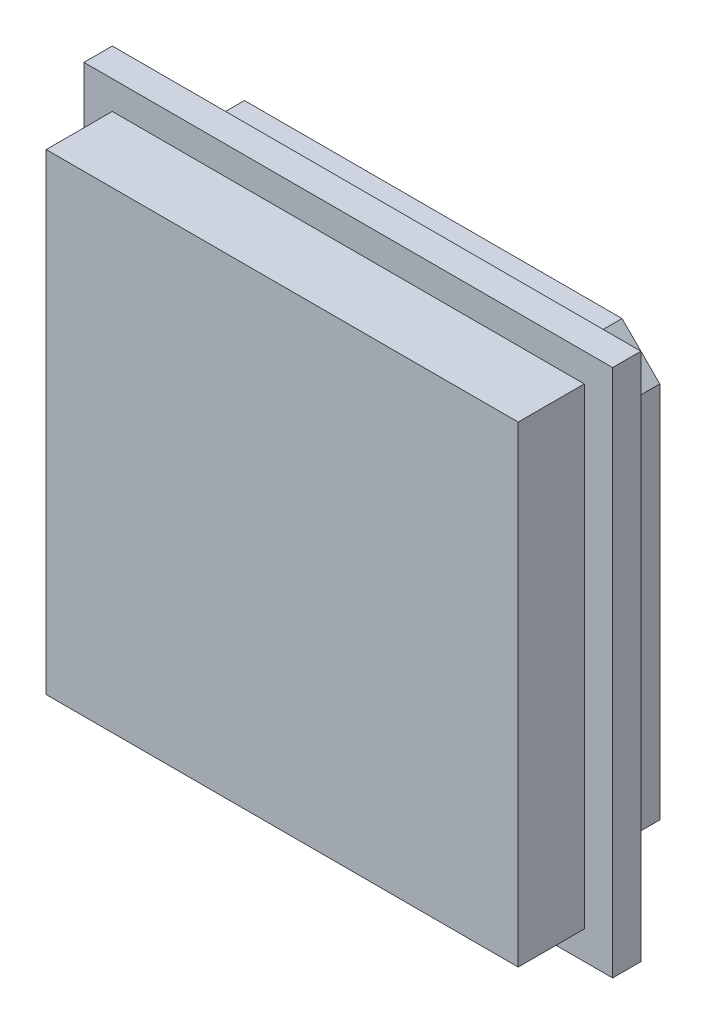
ISO-10303-21;
HEADER;
FILE_DESCRIPTION(('STEP AP214'),'2;1');
FILE_NAME('part.step','',(''),(''),'','','');
FILE_SCHEMA(('AUTOMOTIVE_DESIGN { 1 0 10303 214 1 1 1 1 }'));
ENDSEC;
DATA;
#1=APPLICATION_CONTEXT('core data for automotive mechanical design processes');
#2=APPLICATION_PROTOCOL_DEFINITION('international standard','automotive_design',2000,#1);
#3=PRODUCT_CONTEXT('',#1,'mechanical');
#4=PRODUCT('Part','Part','',(#3));
#5=PRODUCT_RELATED_PRODUCT_CATEGORY('part','',(#4));
#6=PRODUCT_DEFINITION_FORMATION('','',#4);
#7=PRODUCT_DEFINITION_CONTEXT('part definition',#1,'design');
#8=PRODUCT_DEFINITION('design','',#6,#7);
#9=PRODUCT_DEFINITION_SHAPE('','',#8);
#10=(LENGTH_UNIT() NAMED_UNIT(*) SI_UNIT(.MILLI.,.METRE.));
#11=(NAMED_UNIT(*) PLANE_ANGLE_UNIT() SI_UNIT($,.RADIAN.));
#12=(NAMED_UNIT(*) SI_UNIT($,.STERADIAN.) SOLID_ANGLE_UNIT());
#13=UNCERTAINTY_MEASURE_WITH_UNIT(LENGTH_MEASURE(1.E-05),#10,'distance_accuracy_value','');
#14=(GEOMETRIC_REPRESENTATION_CONTEXT(3) GLOBAL_UNCERTAINTY_ASSIGNED_CONTEXT((#13)) GLOBAL_UNIT_ASSIGNED_CONTEXT((#10,
#11,#12)) REPRESENTATION_CONTEXT('',''));
#15=CARTESIAN_POINT('',(0.,0.,0.));
#16=DIRECTION('',(0.,0.,1.));
#17=DIRECTION('',(1.,0.,0.));
#18=AXIS2_PLACEMENT_3D('',#15,#16,#17);
#19=CARTESIAN_POINT('',(0.,0.,4.5));
#20=DIRECTION('',(0.,0.,-1.));
#21=DIRECTION('',(-1.,0.,0.));
#22=AXIS2_PLACEMENT_3D('',#19,#20,#21);
#23=PLANE('',#22);
#24=DIRECTION('',(0.,1.,0.));
#25=VECTOR('',#24,1.);
#26=CARTESIAN_POINT('',(-162.007283518404,38.,4.5));
#27=LINE('',#26,#25);
#28=CARTESIAN_POINT('',(-162.007283518404,10.,4.5));
#29=VERTEX_POINT('',#28);
#30=CARTESIAN_POINT('',(-162.007283518404,38.,4.5));
#31=VERTEX_POINT('',#30);
#32=EDGE_CURVE('E175',#29,#31,#27,.T.);
#33=ORIENTED_EDGE('',*,*,#32,.T.);
#34=DIRECTION('',(-1.,0.,0.));
#35=VECTOR('',#34,1.);
#36=CARTESIAN_POINT('',(-162.007283518404,38.,4.5));
#37=LINE('',#36,#35);
#38=CARTESIAN_POINT('',(-190.007283518404,38.,4.5));
#39=VERTEX_POINT('',#38);
#40=EDGE_CURVE('E178',#31,#39,#37,.T.);
#41=ORIENTED_EDGE('',*,*,#40,.T.);
#42=DIRECTION('',(0.,-1.,0.));
#43=VECTOR('',#42,1.);
#44=CARTESIAN_POINT('',(-190.007283518404,38.,4.5));
#45=LINE('',#44,#43);
#46=CARTESIAN_POINT('',(-190.007283518404,9.99999999999999,4.5));
#47=VERTEX_POINT('',#46);
#48=EDGE_CURVE('E181',#39,#47,#45,.T.);
#49=ORIENTED_EDGE('',*,*,#48,.T.);
#50=DIRECTION('',(1.,0.,0.));
#51=VECTOR('',#50,1.);
#52=CARTESIAN_POINT('',(-162.007283518404,10.,4.5));
#53=LINE('',#52,#51);
#54=EDGE_CURVE('E183',#47,#29,#53,.T.);
#55=ORIENTED_EDGE('',*,*,#54,.T.);
#56=EDGE_LOOP('',(#33,#41,#49,#55));
#57=FACE_BOUND('',#56,.T.);
#58=DIRECTION('',(0.,1.,0.));
#59=VECTOR('',#58,1.);
#60=CARTESIAN_POINT('',(-163.507283518404,36.5,4.5));
#61=LINE('',#60,#59);
#62=CARTESIAN_POINT('',(-163.507283518404,11.5,4.5));
#63=VERTEX_POINT('',#62);
#64=CARTESIAN_POINT('',(-163.507283518404,36.5,4.5));
#65=VERTEX_POINT('',#64);
#66=EDGE_CURVE('E48',#63,#65,#61,.T.);
#67=ORIENTED_EDGE('',*,*,#66,.F.);
#68=DIRECTION('',(1.,0.,0.));
#69=VECTOR('',#68,1.);
#70=CARTESIAN_POINT('',(-163.507283518404,11.5,4.5));
#71=LINE('',#70,#69);
#72=CARTESIAN_POINT('',(-188.507283518404,11.5,4.5));
#73=VERTEX_POINT('',#72);
#74=EDGE_CURVE('E52',#73,#63,#71,.T.);
#75=ORIENTED_EDGE('',*,*,#74,.F.);
#76=DIRECTION('',(0.,-1.,0.));
#77=VECTOR('',#76,1.);
#78=CARTESIAN_POINT('',(-188.507283518404,36.5,4.5));
#79=LINE('',#78,#77);
#80=CARTESIAN_POINT('',(-188.507283518404,36.5,4.5));
#81=VERTEX_POINT('',#80);
#82=EDGE_CURVE('E469',#81,#73,#79,.T.);
#83=ORIENTED_EDGE('',*,*,#82,.F.);
#84=DIRECTION('',(-1.,0.,0.));
#85=VECTOR('',#84,1.);
#86=CARTESIAN_POINT('',(-163.507283518404,36.5,4.5));
#87=LINE('',#86,#85);
#88=EDGE_CURVE('E475',#65,#81,#87,.T.);
#89=ORIENTED_EDGE('',*,*,#88,.F.);
#90=EDGE_LOOP('',(#67,#75,#83,#89));
#91=FACE_BOUND('',#90,.T.);
#92=ADVANCED_FACE('F33',(#57,#91),#23,.F.);
#93=CARTESIAN_POINT('',(-186.007283518404,36.,3.));
#94=DIRECTION('',(0.707106781186548,-0.707106781186548,0.));
#95=DIRECTION('',(0.707106781186548,0.707106781186548,0.));
#96=AXIS2_PLACEMENT_3D('',#93,#94,#95);
#97=PLANE('',#96);
#98=DIRECTION('',(-0.707106781186547,-0.707106781186547,0.));
#99=VECTOR('',#98,1.);
#100=CARTESIAN_POINT('',(-186.007283518404,36.,0.));
#101=LINE('',#100,#99);
#102=CARTESIAN_POINT('',(-186.007283518404,36.,0.));
#103=VERTEX_POINT('',#102);
#104=CARTESIAN_POINT('',(-188.007283518404,34.,0.));
#105=VERTEX_POINT('',#104);
#106=EDGE_CURVE('E201',#103,#105,#101,.T.);
#107=ORIENTED_EDGE('',*,*,#106,.T.);
#108=DIRECTION('',(0.,0.,-1.));
#109=VECTOR('',#108,1.);
#110=CARTESIAN_POINT('',(-188.007283518404,34.,3.));
#111=LINE('',#110,#109);
#112=CARTESIAN_POINT('',(-188.007283518404,34.,3.));
#113=VERTEX_POINT('',#112);
#114=EDGE_CURVE('E11',#113,#105,#111,.T.);
#115=ORIENTED_EDGE('',*,*,#114,.F.);
#116=DIRECTION('',(-0.707106781186547,-0.707106781186547,0.));
#117=VECTOR('',#116,1.);
#118=CARTESIAN_POINT('',(-186.007283518404,36.,3.));
#119=LINE('',#118,#117);
#120=CARTESIAN_POINT('',(-186.007283518404,36.,3.));
#121=VERTEX_POINT('',#120);
#122=EDGE_CURVE('E202',#121,#113,#119,.T.);
#123=ORIENTED_EDGE('',*,*,#122,.F.);
#124=DIRECTION('',(0.,0.,-1.));
#125=VECTOR('',#124,1.);
#126=CARTESIAN_POINT('',(-186.007283518404,36.,3.));
#127=LINE('',#126,#125);
#128=EDGE_CURVE('E227',#121,#103,#127,.T.);
#129=ORIENTED_EDGE('',*,*,#128,.T.);
#130=EDGE_LOOP('',(#107,#115,#123,#129));
#131=FACE_BOUND('',#130,.T.);
#132=ADVANCED_FACE('F35',(#131),#97,.F.);
#133=CARTESIAN_POINT('',(-188.007283518404,34.,3.));
#134=DIRECTION('',(1.,0.,0.));
#135=DIRECTION('',(0.,0.,-1.));
#136=AXIS2_PLACEMENT_3D('',#133,#134,#135);
#137=PLANE('',#136);
#138=DIRECTION('',(0.,-1.,0.));
#139=VECTOR('',#138,1.);
#140=CARTESIAN_POINT('',(-188.007283518404,34.,0.));
#141=LINE('',#140,#139);
#142=CARTESIAN_POINT('',(-188.007283518404,14.,0.));
#143=VERTEX_POINT('',#142);
#144=EDGE_CURVE('E230',#105,#143,#141,.T.);
#145=ORIENTED_EDGE('',*,*,#144,.T.);
#146=DIRECTION('',(0.,0.,-1.));
#147=VECTOR('',#146,1.);
#148=CARTESIAN_POINT('',(-188.007283518404,14.,3.));
#149=LINE('',#148,#147);
#150=CARTESIAN_POINT('',(-188.007283518404,14.,3.));
#151=VERTEX_POINT('',#150);
#152=EDGE_CURVE('E41',#151,#143,#149,.T.);
#153=ORIENTED_EDGE('',*,*,#152,.F.);
#154=DIRECTION('',(0.,-1.,0.));
#155=VECTOR('',#154,1.);
#156=CARTESIAN_POINT('',(-188.007283518404,34.,3.));
#157=LINE('',#156,#155);
#158=EDGE_CURVE('E205',#113,#151,#157,.T.);
#159=ORIENTED_EDGE('',*,*,#158,.F.);
#160=ORIENTED_EDGE('',*,*,#114,.T.);
#161=EDGE_LOOP('',(#145,#153,#159,#160));
#162=FACE_BOUND('',#161,.T.);
#163=ADVANCED_FACE('F282',(#162),#137,.F.);
#164=CARTESIAN_POINT('',(-186.007283518404,12.,3.));
#165=DIRECTION('',(0.707106781186547,0.707106781186548,0.));
#166=DIRECTION('',(-0.707106781186548,0.707106781186547,0.));
#167=AXIS2_PLACEMENT_3D('',#164,#165,#166);
#168=PLANE('',#167);
#169=DIRECTION('',(0.707106781186548,-0.707106781186547,0.));
#170=VECTOR('',#169,1.);
#171=CARTESIAN_POINT('',(-186.007283518404,12.,0.));
#172=LINE('',#171,#170);
#173=CARTESIAN_POINT('',(-186.007283518404,12.,0.));
#174=VERTEX_POINT('',#173);
#175=EDGE_CURVE('E232',#143,#174,#172,.T.);
#176=ORIENTED_EDGE('',*,*,#175,.T.);
#177=DIRECTION('',(0.,0.,-1.));
#178=VECTOR('',#177,1.);
#179=CARTESIAN_POINT('',(-186.007283518404,12.,3.));
#180=LINE('',#179,#178);
#181=CARTESIAN_POINT('',(-186.007283518404,12.,3.));
#182=VERTEX_POINT('',#181);
#183=EDGE_CURVE('E257',#182,#174,#180,.T.);
#184=ORIENTED_EDGE('',*,*,#183,.F.);
#185=DIRECTION('',(0.707106781186548,-0.707106781186547,0.));
#186=VECTOR('',#185,1.);
#187=CARTESIAN_POINT('',(-186.007283518404,12.,3.));
#188=LINE('',#187,#186);
#189=EDGE_CURVE('E209',#151,#182,#188,.T.);
#190=ORIENTED_EDGE('',*,*,#189,.F.);
#191=ORIENTED_EDGE('',*,*,#152,.T.);
#192=EDGE_LOOP('',(#176,#184,#190,#191));
#193=FACE_BOUND('',#192,.T.);
#194=ADVANCED_FACE('F263',(#193),#168,.F.);
#195=CARTESIAN_POINT('',(-166.007283518404,12.,3.));
#196=DIRECTION('',(0.,1.,0.));
#197=DIRECTION('',(-1.,0.,0.));
#198=AXIS2_PLACEMENT_3D('',#195,#196,#197);
#199=PLANE('',#198);
#200=DIRECTION('',(1.,0.,0.));
#201=VECTOR('',#200,1.);
#202=CARTESIAN_POINT('',(-166.007283518404,12.,0.));
#203=LINE('',#202,#201);
#204=CARTESIAN_POINT('',(-166.007283518404,12.,0.));
#205=VERTEX_POINT('',#204);
#206=EDGE_CURVE('E234',#174,#205,#203,.T.);
#207=ORIENTED_EDGE('',*,*,#206,.T.);
#208=DIRECTION('',(0.,0.,-1.));
#209=VECTOR('',#208,1.);
#210=CARTESIAN_POINT('',(-166.007283518404,12.,3.));
#211=LINE('',#210,#209);
#212=CARTESIAN_POINT('',(-166.007283518404,12.,3.));
#213=VERTEX_POINT('',#212);
#214=EDGE_CURVE('E254',#213,#205,#211,.T.);
#215=ORIENTED_EDGE('',*,*,#214,.F.);
#216=DIRECTION('',(1.,0.,0.));
#217=VECTOR('',#216,1.);
#218=CARTESIAN_POINT('',(-166.007283518404,12.,3.));
#219=LINE('',#218,#217);
#220=EDGE_CURVE('E212',#182,#213,#219,.T.);
#221=ORIENTED_EDGE('',*,*,#220,.F.);
#222=ORIENTED_EDGE('',*,*,#183,.T.);
#223=EDGE_LOOP('',(#207,#215,#221,#222));
#224=FACE_BOUND('',#223,.T.);
#225=ADVANCED_FACE('F272',(#224),#199,.F.);
#226=CARTESIAN_POINT('',(-164.007283518404,14.,3.));
#227=DIRECTION('',(-0.707106781186547,0.707106781186548,0.));
#228=DIRECTION('',(-0.707106781186548,-0.707106781186547,0.));
#229=AXIS2_PLACEMENT_3D('',#226,#227,#228);
#230=PLANE('',#229);
#231=DIRECTION('',(0.707106781186548,0.707106781186547,0.));
#232=VECTOR('',#231,1.);
#233=CARTESIAN_POINT('',(-164.007283518404,14.,0.));
#234=LINE('',#233,#232);
#235=CARTESIAN_POINT('',(-164.007283518404,14.,0.));
#236=VERTEX_POINT('',#235);
#237=EDGE_CURVE('E236',#205,#236,#234,.T.);
#238=ORIENTED_EDGE('',*,*,#237,.T.);
#239=DIRECTION('',(0.,0.,-1.));
#240=VECTOR('',#239,1.);
#241=CARTESIAN_POINT('',(-164.007283518404,14.,3.));
#242=LINE('',#241,#240);
#243=CARTESIAN_POINT('',(-164.007283518404,14.,3.));
#244=VERTEX_POINT('',#243);
#245=EDGE_CURVE('E251',#244,#236,#242,.T.);
#246=ORIENTED_EDGE('',*,*,#245,.F.);
#247=DIRECTION('',(0.707106781186548,0.707106781186547,0.));
#248=VECTOR('',#247,1.);
#249=CARTESIAN_POINT('',(-164.007283518404,14.,3.));
#250=LINE('',#249,#248);
#251=EDGE_CURVE('E215',#213,#244,#250,.T.);
#252=ORIENTED_EDGE('',*,*,#251,.F.);
#253=ORIENTED_EDGE('',*,*,#214,.T.);
#254=EDGE_LOOP('',(#238,#246,#252,#253));
#255=FACE_BOUND('',#254,.T.);
#256=ADVANCED_FACE('F276',(#255),#230,.F.);
#257=CARTESIAN_POINT('',(-164.007283518404,34.,3.));
#258=DIRECTION('',(-1.,0.,0.));
#259=DIRECTION('',(0.,0.,1.));
#260=AXIS2_PLACEMENT_3D('',#257,#258,#259);
#261=PLANE('',#260);
#262=DIRECTION('',(0.,1.,0.));
#263=VECTOR('',#262,1.);
#264=CARTESIAN_POINT('',(-164.007283518404,34.,0.));
#265=LINE('',#264,#263);
#266=CARTESIAN_POINT('',(-164.007283518404,34.,0.));
#267=VERTEX_POINT('',#266);
#268=EDGE_CURVE('E238',#236,#267,#265,.T.);
#269=ORIENTED_EDGE('',*,*,#268,.T.);
#270=DIRECTION('',(0.,0.,-1.));
#271=VECTOR('',#270,1.);
#272=CARTESIAN_POINT('',(-164.007283518404,34.,3.));
#273=LINE('',#272,#271);
#274=CARTESIAN_POINT('',(-164.007283518404,34.,3.));
#275=VERTEX_POINT('',#274);
#276=EDGE_CURVE('E248',#275,#267,#273,.T.);
#277=ORIENTED_EDGE('',*,*,#276,.F.);
#278=DIRECTION('',(0.,1.,0.));
#279=VECTOR('',#278,1.);
#280=CARTESIAN_POINT('',(-164.007283518404,34.,3.));
#281=LINE('',#280,#279);
#282=EDGE_CURVE('E218',#244,#275,#281,.T.);
#283=ORIENTED_EDGE('',*,*,#282,.F.);
#284=ORIENTED_EDGE('',*,*,#245,.T.);
#285=EDGE_LOOP('',(#269,#277,#283,#284));
#286=FACE_BOUND('',#285,.T.);
#287=ADVANCED_FACE('F294',(#286),#261,.F.);
#288=CARTESIAN_POINT('',(-164.007283518404,34.,3.));
#289=DIRECTION('',(-0.707106781186548,-0.707106781186548,0.));
#290=DIRECTION('',(0.707106781186548,-0.707106781186548,0.));
#291=AXIS2_PLACEMENT_3D('',#288,#289,#290);
#292=PLANE('',#291);
#293=DIRECTION('',(-0.707106781186547,0.707106781186547,0.));
#294=VECTOR('',#293,1.);
#295=CARTESIAN_POINT('',(-164.007283518404,34.,0.));
#296=LINE('',#295,#294);
#297=CARTESIAN_POINT('',(-166.007283518404,36.,0.));
#298=VERTEX_POINT('',#297);
#299=EDGE_CURVE('E240',#267,#298,#296,.T.);
#300=ORIENTED_EDGE('',*,*,#299,.T.);
#301=DIRECTION('',(0.,0.,-1.));
#302=VECTOR('',#301,1.);
#303=CARTESIAN_POINT('',(-166.007283518404,36.,3.));
#304=LINE('',#303,#302);
#305=CARTESIAN_POINT('',(-166.007283518404,36.,3.));
#306=VERTEX_POINT('',#305);
#307=EDGE_CURVE('E245',#306,#298,#304,.T.);
#308=ORIENTED_EDGE('',*,*,#307,.F.);
#309=DIRECTION('',(-0.707106781186547,0.707106781186547,0.));
#310=VECTOR('',#309,1.);
#311=CARTESIAN_POINT('',(-164.007283518404,34.,3.));
#312=LINE('',#311,#310);
#313=EDGE_CURVE('E221',#275,#306,#312,.T.);
#314=ORIENTED_EDGE('',*,*,#313,.F.);
#315=ORIENTED_EDGE('',*,*,#276,.T.);
#316=EDGE_LOOP('',(#300,#308,#314,#315));
#317=FACE_BOUND('',#316,.T.);
#318=ADVANCED_FACE('F292',(#317),#292,.F.);
#319=CARTESIAN_POINT('',(-166.007283518404,36.,3.));
#320=DIRECTION('',(0.,-1.,0.));
#321=DIRECTION('',(0.,0.,-1.));
#322=AXIS2_PLACEMENT_3D('',#319,#320,#321);
#323=PLANE('',#322);
#324=DIRECTION('',(-1.,0.,0.));
#325=VECTOR('',#324,1.);
#326=CARTESIAN_POINT('',(-166.007283518404,36.,0.));
#327=LINE('',#326,#325);
#328=EDGE_CURVE('E206',#298,#103,#327,.T.);
#329=ORIENTED_EDGE('',*,*,#328,.T.);
#330=ORIENTED_EDGE('',*,*,#128,.F.);
#331=DIRECTION('',(-1.,0.,0.));
#332=VECTOR('',#331,1.);
#333=CARTESIAN_POINT('',(-166.007283518404,36.,3.));
#334=LINE('',#333,#332);
#335=EDGE_CURVE('E224',#306,#121,#334,.T.);
#336=ORIENTED_EDGE('',*,*,#335,.F.);
#337=ORIENTED_EDGE('',*,*,#307,.T.);
#338=EDGE_LOOP('',(#329,#330,#336,#337));
#339=FACE_BOUND('',#338,.T.);
#340=ADVANCED_FACE('F288',(#339),#323,.F.);
#341=CARTESIAN_POINT('',(0.,0.,0.));
#342=DIRECTION('',(0.,0.,-1.));
#343=DIRECTION('',(-1.,0.,0.));
#344=AXIS2_PLACEMENT_3D('',#341,#342,#343);
#345=PLANE('',#344);
#346=ORIENTED_EDGE('',*,*,#106,.F.);
#347=ORIENTED_EDGE('',*,*,#328,.F.);
#348=ORIENTED_EDGE('',*,*,#299,.F.);
#349=ORIENTED_EDGE('',*,*,#268,.F.);
#350=ORIENTED_EDGE('',*,*,#237,.F.);
#351=ORIENTED_EDGE('',*,*,#206,.F.);
#352=ORIENTED_EDGE('',*,*,#175,.F.);
#353=ORIENTED_EDGE('',*,*,#144,.F.);
#354=EDGE_LOOP('',(#346,#347,#348,#349,#350,#351,#352,#353));
#355=FACE_BOUND('',#354,.T.);
#356=ADVANCED_FACE('F268',(#355),#345,.T.);
#357=CARTESIAN_POINT('',(-162.007283518404,38.,4.5));
#358=DIRECTION('',(-1.,0.,0.));
#359=DIRECTION('',(0.,0.,1.));
#360=AXIS2_PLACEMENT_3D('',#357,#358,#359);
#361=PLANE('',#360);
#362=DIRECTION('',(0.,1.,0.));
#363=VECTOR('',#362,1.);
#364=CARTESIAN_POINT('',(-162.007283518404,38.,3.));
#365=LINE('',#364,#363);
#366=CARTESIAN_POINT('',(-162.007283518404,10.,3.));
#367=VERTEX_POINT('',#366);
#368=CARTESIAN_POINT('',(-162.007283518404,38.,3.));
#369=VERTEX_POINT('',#368);
#370=EDGE_CURVE('E166',#367,#369,#365,.T.);
#371=ORIENTED_EDGE('',*,*,#370,.T.);
#372=DIRECTION('',(0.,0.,-1.));
#373=VECTOR('',#372,1.);
#374=CARTESIAN_POINT('',(-162.007283518404,38.,4.5));
#375=LINE('',#374,#373);
#376=EDGE_CURVE('E198',#31,#369,#375,.T.);
#377=ORIENTED_EDGE('',*,*,#376,.F.);
#378=ORIENTED_EDGE('',*,*,#32,.F.);
#379=DIRECTION('',(0.,0.,-1.));
#380=VECTOR('',#379,1.);
#381=CARTESIAN_POINT('',(-162.007283518404,10.,4.5));
#382=LINE('',#381,#380);
#383=EDGE_CURVE('E184',#29,#367,#382,.T.);
#384=ORIENTED_EDGE('',*,*,#383,.T.);
#385=EDGE_LOOP('',(#371,#377,#378,#384));
#386=FACE_BOUND('',#385,.T.);
#387=ADVANCED_FACE('F325',(#386),#361,.F.);
#388=CARTESIAN_POINT('',(-162.007283518404,38.,4.5));
#389=DIRECTION('',(0.,-1.,0.));
#390=DIRECTION('',(0.,0.,-1.));
#391=AXIS2_PLACEMENT_3D('',#388,#389,#390);
#392=PLANE('',#391);
#393=DIRECTION('',(-1.,0.,0.));
#394=VECTOR('',#393,1.);
#395=CARTESIAN_POINT('',(-162.007283518404,38.,3.));
#396=LINE('',#395,#394);
#397=CARTESIAN_POINT('',(-190.007283518404,38.,3.));
#398=VERTEX_POINT('',#397);
#399=EDGE_CURVE('E169',#369,#398,#396,.T.);
#400=ORIENTED_EDGE('',*,*,#399,.T.);
#401=DIRECTION('',(0.,0.,-1.));
#402=VECTOR('',#401,1.);
#403=CARTESIAN_POINT('',(-190.007283518404,38.,4.5));
#404=LINE('',#403,#402);
#405=EDGE_CURVE('E195',#39,#398,#404,.T.);
#406=ORIENTED_EDGE('',*,*,#405,.F.);
#407=ORIENTED_EDGE('',*,*,#40,.F.);
#408=ORIENTED_EDGE('',*,*,#376,.T.);
#409=EDGE_LOOP('',(#400,#406,#407,#408));
#410=FACE_BOUND('',#409,.T.);
#411=ADVANCED_FACE('F321',(#410),#392,.F.);
#412=CARTESIAN_POINT('',(-190.007283518404,38.,4.5));
#413=DIRECTION('',(1.,0.,0.));
#414=DIRECTION('',(0.,0.,-1.));
#415=AXIS2_PLACEMENT_3D('',#412,#413,#414);
#416=PLANE('',#415);
#417=DIRECTION('',(0.,-1.,0.));
#418=VECTOR('',#417,1.);
#419=CARTESIAN_POINT('',(-190.007283518404,38.,3.));
#420=LINE('',#419,#418);
#421=CARTESIAN_POINT('',(-190.007283518404,9.99999999999999,3.));
#422=VERTEX_POINT('',#421);
#423=EDGE_CURVE('E187',#398,#422,#420,.T.);
#424=ORIENTED_EDGE('',*,*,#423,.T.);
#425=DIRECTION('',(0.,0.,-1.));
#426=VECTOR('',#425,1.);
#427=CARTESIAN_POINT('',(-190.007283518404,9.99999999999999,4.5));
#428=LINE('',#427,#426);
#429=EDGE_CURVE('E192',#47,#422,#428,.T.);
#430=ORIENTED_EDGE('',*,*,#429,.F.);
#431=ORIENTED_EDGE('',*,*,#48,.F.);
#432=ORIENTED_EDGE('',*,*,#405,.T.);
#433=EDGE_LOOP('',(#424,#430,#431,#432));
#434=FACE_BOUND('',#433,.T.);
#435=ADVANCED_FACE('F317',(#434),#416,.F.);
#436=CARTESIAN_POINT('',(-162.007283518404,10.,4.5));
#437=DIRECTION('',(0.,1.,0.));
#438=DIRECTION('',(-1.,0.,0.));
#439=AXIS2_PLACEMENT_3D('',#436,#437,#438);
#440=PLANE('',#439);
#441=DIRECTION('',(1.,0.,0.));
#442=VECTOR('',#441,1.);
#443=CARTESIAN_POINT('',(-162.007283518404,10.,3.));
#444=LINE('',#443,#442);
#445=EDGE_CURVE('E179',#422,#367,#444,.T.);
#446=ORIENTED_EDGE('',*,*,#445,.T.);
#447=ORIENTED_EDGE('',*,*,#383,.F.);
#448=ORIENTED_EDGE('',*,*,#54,.F.);
#449=ORIENTED_EDGE('',*,*,#429,.T.);
#450=EDGE_LOOP('',(#446,#447,#448,#449));
#451=FACE_BOUND('',#450,.T.);
#452=ADVANCED_FACE('F314',(#451),#440,.F.);
#453=CARTESIAN_POINT('',(0.,0.,3.));
#454=DIRECTION('',(0.,0.,-1.));
#455=DIRECTION('',(-1.,0.,0.));
#456=AXIS2_PLACEMENT_3D('',#453,#454,#455);
#457=PLANE('',#456);
#458=ORIENTED_EDGE('',*,*,#335,.T.);
#459=ORIENTED_EDGE('',*,*,#122,.T.);
#460=ORIENTED_EDGE('',*,*,#158,.T.);
#461=ORIENTED_EDGE('',*,*,#189,.T.);
#462=ORIENTED_EDGE('',*,*,#220,.T.);
#463=ORIENTED_EDGE('',*,*,#251,.T.);
#464=ORIENTED_EDGE('',*,*,#282,.T.);
#465=ORIENTED_EDGE('',*,*,#313,.T.);
#466=EDGE_LOOP('',(#458,#459,#460,#461,#462,#463,#464,#465));
#467=FACE_BOUND('',#466,.T.);
#468=ORIENTED_EDGE('',*,*,#370,.F.);
#469=ORIENTED_EDGE('',*,*,#445,.F.);
#470=ORIENTED_EDGE('',*,*,#423,.F.);
#471=ORIENTED_EDGE('',*,*,#399,.F.);
#472=EDGE_LOOP('',(#468,#469,#470,#471));
#473=FACE_BOUND('',#472,.T.);
#474=ADVANCED_FACE('F279',(#467,#473),#457,.T.);
#475=CARTESIAN_POINT('',(-163.507283518404,36.5,8.));
#476=DIRECTION('',(-1.,0.,0.));
#477=DIRECTION('',(0.,0.,1.));
#478=AXIS2_PLACEMENT_3D('',#475,#476,#477);
#479=PLANE('',#478);
#480=ORIENTED_EDGE('',*,*,#66,.T.);
#481=DIRECTION('',(0.,0.,-1.));
#482=VECTOR('',#481,1.);
#483=CARTESIAN_POINT('',(-163.507283518404,36.5,8.));
#484=LINE('',#483,#482);
#485=CARTESIAN_POINT('',(-163.507283518404,36.5,8.));
#486=VERTEX_POINT('',#485);
#487=EDGE_CURVE('E149',#486,#65,#484,.T.);
#488=ORIENTED_EDGE('',*,*,#487,.F.);
#489=DIRECTION('',(0.,1.,0.));
#490=VECTOR('',#489,1.);
#491=CARTESIAN_POINT('',(-163.507283518404,36.5,8.));
#492=LINE('',#491,#490);
#493=CARTESIAN_POINT('',(-163.507283518404,11.5,8.));
#494=VERTEX_POINT('',#493);
#495=EDGE_CURVE('E155',#494,#486,#492,.T.);
#496=ORIENTED_EDGE('',*,*,#495,.F.);
#497=DIRECTION('',(0.,0.,-1.));
#498=VECTOR('',#497,1.);
#499=CARTESIAN_POINT('',(-163.507283518404,11.5,8.));
#500=LINE('',#499,#498);
#501=EDGE_CURVE('E467',#494,#63,#500,.T.);
#502=ORIENTED_EDGE('',*,*,#501,.T.);
#503=EDGE_LOOP('',(#480,#488,#496,#502));
#504=FACE_BOUND('',#503,.T.);
#505=ADVANCED_FACE('F165',(#504),#479,.F.);
#506=CARTESIAN_POINT('',(-163.507283518404,36.5,8.));
#507=DIRECTION('',(0.,-1.,0.));
#508=DIRECTION('',(1.,0.,0.));
#509=AXIS2_PLACEMENT_3D('',#506,#507,#508);
#510=PLANE('',#509);
#511=ORIENTED_EDGE('',*,*,#88,.T.);
#512=DIRECTION('',(0.,0.,-1.));
#513=VECTOR('',#512,1.);
#514=CARTESIAN_POINT('',(-188.507283518404,36.5,8.));
#515=LINE('',#514,#513);
#516=CARTESIAN_POINT('',(-188.507283518404,36.5,8.));
#517=VERTEX_POINT('',#516);
#518=EDGE_CURVE('E151',#517,#81,#515,.T.);
#519=ORIENTED_EDGE('',*,*,#518,.F.);
#520=DIRECTION('',(-1.,0.,0.));
#521=VECTOR('',#520,1.);
#522=CARTESIAN_POINT('',(-163.507283518404,36.5,8.));
#523=LINE('',#522,#521);
#524=EDGE_CURVE('E144',#486,#517,#523,.T.);
#525=ORIENTED_EDGE('',*,*,#524,.F.);
#526=ORIENTED_EDGE('',*,*,#487,.T.);
#527=EDGE_LOOP('',(#511,#519,#525,#526));
#528=FACE_BOUND('',#527,.T.);
#529=ADVANCED_FACE('F147',(#528),#510,.F.);
#530=CARTESIAN_POINT('',(-188.507283518404,36.5,8.));
#531=DIRECTION('',(1.,0.,0.));
#532=DIRECTION('',(0.,0.,-1.));
#533=AXIS2_PLACEMENT_3D('',#530,#531,#532);
#534=PLANE('',#533);
#535=ORIENTED_EDGE('',*,*,#82,.T.);
#536=DIRECTION('',(0.,0.,-1.));
#537=VECTOR('',#536,1.);
#538=CARTESIAN_POINT('',(-188.507283518404,11.5,8.));
#539=LINE('',#538,#537);
#540=CARTESIAN_POINT('',(-188.507283518404,11.5,8.));
#541=VERTEX_POINT('',#540);
#542=EDGE_CURVE('E171',#541,#73,#539,.T.);
#543=ORIENTED_EDGE('',*,*,#542,.F.);
#544=DIRECTION('',(0.,-1.,0.));
#545=VECTOR('',#544,1.);
#546=CARTESIAN_POINT('',(-188.507283518404,36.5,8.));
#547=LINE('',#546,#545);
#548=EDGE_CURVE('E154',#517,#541,#547,.T.);
#549=ORIENTED_EDGE('',*,*,#548,.F.);
#550=ORIENTED_EDGE('',*,*,#518,.T.);
#551=EDGE_LOOP('',(#535,#543,#549,#550));
#552=FACE_BOUND('',#551,.T.);
#553=ADVANCED_FACE('F373',(#552),#534,.F.);
#554=CARTESIAN_POINT('',(-163.507283518404,11.5,8.));
#555=DIRECTION('',(0.,1.,0.));
#556=DIRECTION('',(-1.,0.,0.));
#557=AXIS2_PLACEMENT_3D('',#554,#555,#556);
#558=PLANE('',#557);
#559=ORIENTED_EDGE('',*,*,#74,.T.);
#560=ORIENTED_EDGE('',*,*,#501,.F.);
#561=DIRECTION('',(1.,0.,0.));
#562=VECTOR('',#561,1.);
#563=CARTESIAN_POINT('',(-163.507283518404,11.5,8.));
#564=LINE('',#563,#562);
#565=EDGE_CURVE('E160',#541,#494,#564,.T.);
#566=ORIENTED_EDGE('',*,*,#565,.F.);
#567=ORIENTED_EDGE('',*,*,#542,.T.);
#568=EDGE_LOOP('',(#559,#560,#566,#567));
#569=FACE_BOUND('',#568,.T.);
#570=ADVANCED_FACE('F379',(#569),#558,.F.);
#571=CARTESIAN_POINT('',(0.,0.,8.));
#572=DIRECTION('',(0.,0.,-1.));
#573=DIRECTION('',(-1.,0.,0.));
#574=AXIS2_PLACEMENT_3D('',#571,#572,#573);
#575=PLANE('',#574);
#576=ORIENTED_EDGE('',*,*,#495,.T.);
#577=ORIENTED_EDGE('',*,*,#524,.T.);
#578=ORIENTED_EDGE('',*,*,#548,.T.);
#579=ORIENTED_EDGE('',*,*,#565,.T.);
#580=EDGE_LOOP('',(#576,#577,#578,#579));
#581=FACE_BOUND('',#580,.T.);
#582=ADVANCED_FACE('F158',(#581),#575,.F.);
#583=CLOSED_SHELL('',(#92,#132,#163,#194,#225,#256,#287,#318,#340,#356,#387,#411,#435,#452,#474,
#505,#529,#553,#570,#582));
#584=MANIFOLD_SOLID_BREP('B2',#583);
#585=ADVANCED_BREP_SHAPE_REPRESENTATION('',(#18,#584),#14);
#586=SHAPE_DEFINITION_REPRESENTATION(#9,#585);
ENDSEC;
END-ISO-10303-21;
